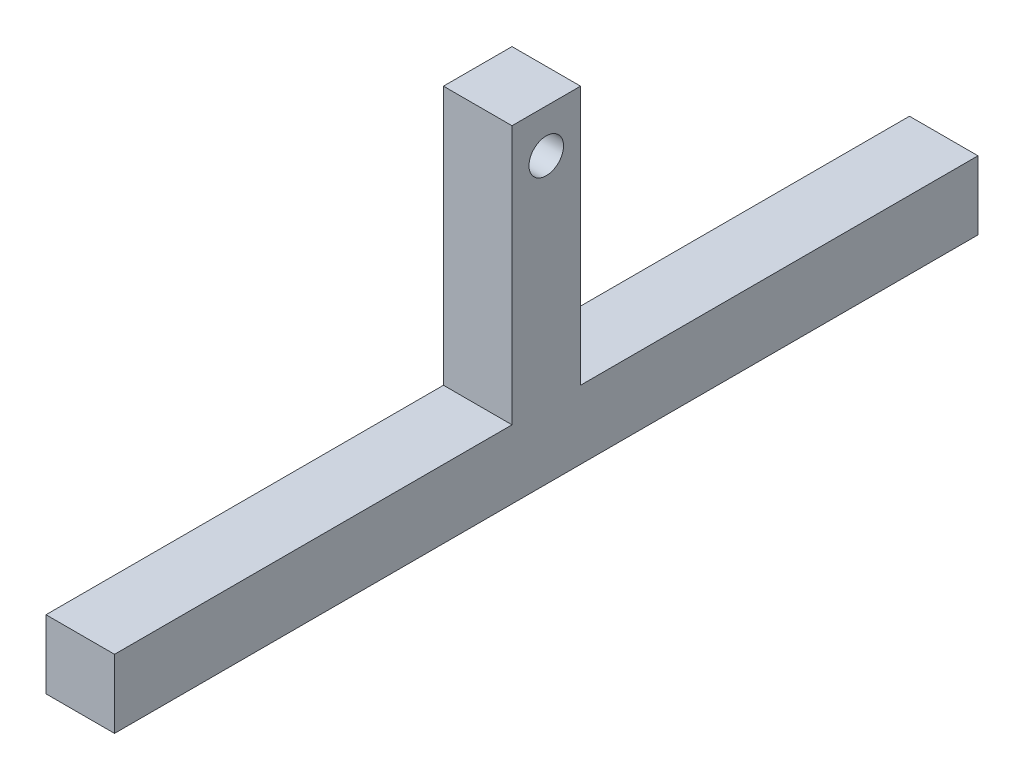
ISO-10303-21;
HEADER;
FILE_DESCRIPTION(('STEP AP214'),'2;1');
FILE_NAME('part.step','',(''),(''),'','','');
FILE_SCHEMA(('AUTOMOTIVE_DESIGN { 1 0 10303 214 1 1 1 1 }'));
ENDSEC;
DATA;
#1=APPLICATION_CONTEXT('core data for automotive mechanical design processes');
#2=APPLICATION_PROTOCOL_DEFINITION('international standard','automotive_design',2000,#1);
#3=PRODUCT_CONTEXT('',#1,'mechanical');
#4=PRODUCT('Part','Part','',(#3));
#5=PRODUCT_RELATED_PRODUCT_CATEGORY('part','',(#4));
#6=PRODUCT_DEFINITION_FORMATION('','',#4);
#7=PRODUCT_DEFINITION_CONTEXT('part definition',#1,'design');
#8=PRODUCT_DEFINITION('design','',#6,#7);
#9=PRODUCT_DEFINITION_SHAPE('','',#8);
#10=(LENGTH_UNIT() NAMED_UNIT(*) SI_UNIT(.MILLI.,.METRE.));
#11=(NAMED_UNIT(*) PLANE_ANGLE_UNIT() SI_UNIT($,.RADIAN.));
#12=(NAMED_UNIT(*) SI_UNIT($,.STERADIAN.) SOLID_ANGLE_UNIT());
#13=UNCERTAINTY_MEASURE_WITH_UNIT(LENGTH_MEASURE(1.E-05),#10,'distance_accuracy_value','');
#14=(GEOMETRIC_REPRESENTATION_CONTEXT(3) GLOBAL_UNCERTAINTY_ASSIGNED_CONTEXT((#13)) GLOBAL_UNIT_ASSIGNED_CONTEXT((#10,
#11,#12)) REPRESENTATION_CONTEXT('',''));
#15=CARTESIAN_POINT('',(0.,0.,0.));
#16=DIRECTION('',(0.,0.,1.));
#17=DIRECTION('',(1.,0.,0.));
#18=AXIS2_PLACEMENT_3D('',#15,#16,#17);
#19=CARTESIAN_POINT('',(15.875,0.,100.));
#20=DIRECTION('',(0.,0.,1.));
#21=DIRECTION('',(-1.,0.,0.));
#22=AXIS2_PLACEMENT_3D('',#19,#20,#21);
#23=PLANE('',#22);
#24=DIRECTION('',(0.,-1.,0.));
#25=VECTOR('',#24,1.);
#26=CARTESIAN_POINT('',(0.,0.,100.));
#27=LINE('',#26,#25);
#28=CARTESIAN_POINT('',(0.,7.9375,100.));
#29=VERTEX_POINT('',#28);
#30=CARTESIAN_POINT('',(0.,-7.9375,100.));
#31=VERTEX_POINT('',#30);
#32=EDGE_CURVE('E145',#29,#31,#27,.T.);
#33=ORIENTED_EDGE('',*,*,#32,.T.);
#34=DIRECTION('',(-1.,0.,0.));
#35=VECTOR('',#34,1.);
#36=CARTESIAN_POINT('',(15.875,-7.9375,100.));
#37=LINE('',#36,#35);
#38=CARTESIAN_POINT('',(15.875,-7.9375,100.));
#39=VERTEX_POINT('',#38);
#40=EDGE_CURVE('E164',#39,#31,#37,.T.);
#41=ORIENTED_EDGE('',*,*,#40,.F.);
#42=DIRECTION('',(0.,-1.,0.));
#43=VECTOR('',#42,1.);
#44=CARTESIAN_POINT('',(15.875,0.,100.));
#45=LINE('',#44,#43);
#46=CARTESIAN_POINT('',(15.875,7.9375,100.));
#47=VERTEX_POINT('',#46);
#48=EDGE_CURVE('E134',#47,#39,#45,.T.);
#49=ORIENTED_EDGE('',*,*,#48,.F.);
#50=DIRECTION('',(-1.,0.,0.));
#51=VECTOR('',#50,1.);
#52=CARTESIAN_POINT('',(15.875,7.9375,100.));
#53=LINE('',#52,#51);
#54=EDGE_CURVE('E11',#47,#29,#53,.T.);
#55=ORIENTED_EDGE('',*,*,#54,.T.);
#56=EDGE_LOOP('',(#33,#41,#49,#55));
#57=FACE_BOUND('',#56,.T.);
#58=ADVANCED_FACE('F39',(#57),#23,.T.);
#59=CARTESIAN_POINT('',(15.875,7.9375,0.));
#60=DIRECTION('',(0.,1.,0.));
#61=DIRECTION('',(0.,0.,-1.));
#62=AXIS2_PLACEMENT_3D('',#59,#60,#61);
#63=PLANE('',#62);
#64=DIRECTION('',(0.,0.,1.));
#65=VECTOR('',#64,1.);
#66=CARTESIAN_POINT('',(0.,7.9375,0.));
#67=LINE('',#66,#65);
#68=CARTESIAN_POINT('',(0.,7.9375,7.9375));
#69=VERTEX_POINT('',#68);
#70=EDGE_CURVE('E149',#69,#29,#67,.T.);
#71=ORIENTED_EDGE('',*,*,#70,.T.);
#72=ORIENTED_EDGE('',*,*,#54,.F.);
#73=DIRECTION('',(0.,0.,1.));
#74=VECTOR('',#73,1.);
#75=CARTESIAN_POINT('',(15.875,7.9375,0.));
#76=LINE('',#75,#74);
#77=CARTESIAN_POINT('',(15.875,7.9375,7.9375));
#78=VERTEX_POINT('',#77);
#79=EDGE_CURVE('E93',#78,#47,#76,.T.);
#80=ORIENTED_EDGE('',*,*,#79,.F.);
#81=DIRECTION('',(-1.,0.,0.));
#82=VECTOR('',#81,1.);
#83=CARTESIAN_POINT('',(15.875,7.9375,7.9375));
#84=LINE('',#83,#82);
#85=EDGE_CURVE('E47',#78,#69,#84,.T.);
#86=ORIENTED_EDGE('',*,*,#85,.T.);
#87=EDGE_LOOP('',(#71,#72,#80,#86));
#88=FACE_BOUND('',#87,.T.);
#89=ADVANCED_FACE('F177',(#88),#63,.T.);
#90=CARTESIAN_POINT('',(15.875,0.,7.9375));
#91=DIRECTION('',(0.,0.,-1.));
#92=DIRECTION('',(1.,0.,0.));
#93=AXIS2_PLACEMENT_3D('',#90,#91,#92);
#94=PLANE('',#93);
#95=DIRECTION('',(0.,1.,0.));
#96=VECTOR('',#95,1.);
#97=CARTESIAN_POINT('',(0.,0.,7.9375));
#98=LINE('',#97,#96);
#99=CARTESIAN_POINT('',(0.,67.9375,7.9375));
#100=VERTEX_POINT('',#99);
#101=EDGE_CURVE('E152',#69,#100,#98,.T.);
#102=ORIENTED_EDGE('',*,*,#101,.F.);
#103=ORIENTED_EDGE('',*,*,#85,.F.);
#104=DIRECTION('',(0.,1.,0.));
#105=VECTOR('',#104,1.);
#106=CARTESIAN_POINT('',(15.875,0.,7.9375));
#107=LINE('',#106,#105);
#108=CARTESIAN_POINT('',(15.875,67.9375,7.9375));
#109=VERTEX_POINT('',#108);
#110=EDGE_CURVE('E133',#78,#109,#107,.T.);
#111=ORIENTED_EDGE('',*,*,#110,.T.);
#112=DIRECTION('',(-1.,0.,0.));
#113=VECTOR('',#112,1.);
#114=CARTESIAN_POINT('',(15.875,67.9375,7.9375));
#115=LINE('',#114,#113);
#116=EDGE_CURVE('E171',#109,#100,#115,.T.);
#117=ORIENTED_EDGE('',*,*,#116,.T.);
#118=EDGE_LOOP('',(#102,#103,#111,#117));
#119=FACE_BOUND('',#118,.T.);
#120=ADVANCED_FACE('F182',(#119),#94,.F.);
#121=CARTESIAN_POINT('',(15.875,67.9375,0.));
#122=DIRECTION('',(0.,1.,0.));
#123=DIRECTION('',(0.,0.,-1.));
#124=AXIS2_PLACEMENT_3D('',#121,#122,#123);
#125=PLANE('',#124);
#126=DIRECTION('',(0.,0.,1.));
#127=VECTOR('',#126,1.);
#128=CARTESIAN_POINT('',(0.,67.9375,0.));
#129=LINE('',#128,#127);
#130=CARTESIAN_POINT('',(0.,67.9375,-7.9375));
#131=VERTEX_POINT('',#130);
#132=EDGE_CURVE('E159',#131,#100,#129,.T.);
#133=ORIENTED_EDGE('',*,*,#132,.T.);
#134=ORIENTED_EDGE('',*,*,#116,.F.);
#135=DIRECTION('',(0.,0.,1.));
#136=VECTOR('',#135,1.);
#137=CARTESIAN_POINT('',(15.875,67.9375,0.));
#138=LINE('',#137,#136);
#139=CARTESIAN_POINT('',(15.875,67.9375,-7.9375));
#140=VERTEX_POINT('',#139);
#141=EDGE_CURVE('E129',#140,#109,#138,.T.);
#142=ORIENTED_EDGE('',*,*,#141,.F.);
#143=DIRECTION('',(-1.,0.,0.));
#144=VECTOR('',#143,1.);
#145=CARTESIAN_POINT('',(15.875,67.9375,-7.9375));
#146=LINE('',#145,#144);
#147=EDGE_CURVE('E168',#140,#131,#146,.T.);
#148=ORIENTED_EDGE('',*,*,#147,.T.);
#149=EDGE_LOOP('',(#133,#134,#142,#148));
#150=FACE_BOUND('',#149,.T.);
#151=ADVANCED_FACE('F186',(#150),#125,.T.);
#152=CARTESIAN_POINT('',(15.875,0.,-7.9375));
#153=DIRECTION('',(0.,0.,-1.));
#154=DIRECTION('',(1.,0.,0.));
#155=AXIS2_PLACEMENT_3D('',#152,#153,#154);
#156=PLANE('',#155);
#157=DIRECTION('',(0.,1.,0.));
#158=VECTOR('',#157,1.);
#159=CARTESIAN_POINT('',(0.,0.,-7.9375));
#160=LINE('',#159,#158);
#161=CARTESIAN_POINT('',(0.,7.9375,-7.9375));
#162=VERTEX_POINT('',#161);
#163=EDGE_CURVE('E161',#162,#131,#160,.T.);
#164=ORIENTED_EDGE('',*,*,#163,.T.);
#165=ORIENTED_EDGE('',*,*,#147,.F.);
#166=DIRECTION('',(0.,1.,0.));
#167=VECTOR('',#166,1.);
#168=CARTESIAN_POINT('',(15.875,0.,-7.9375));
#169=LINE('',#168,#167);
#170=CARTESIAN_POINT('',(15.875,7.9375,-7.9375));
#171=VERTEX_POINT('',#170);
#172=EDGE_CURVE('E127',#171,#140,#169,.T.);
#173=ORIENTED_EDGE('',*,*,#172,.F.);
#174=DIRECTION('',(-1.,0.,0.));
#175=VECTOR('',#174,1.);
#176=CARTESIAN_POINT('',(15.875,7.9375,-7.9375));
#177=LINE('',#176,#175);
#178=EDGE_CURVE('E121',#171,#162,#177,.T.);
#179=ORIENTED_EDGE('',*,*,#178,.T.);
#180=EDGE_LOOP('',(#164,#165,#173,#179));
#181=FACE_BOUND('',#180,.T.);
#182=ADVANCED_FACE('F189',(#181),#156,.T.);
#183=CARTESIAN_POINT('',(0.,7.9375,-100.));
#184=VERTEX_POINT('',#183);
#185=EDGE_CURVE('E154',#184,#162,#67,.T.);
#186=ORIENTED_EDGE('',*,*,#185,.T.);
#187=ORIENTED_EDGE('',*,*,#178,.F.);
#188=CARTESIAN_POINT('',(15.875,7.9375,-100.));
#189=VERTEX_POINT('',#188);
#190=EDGE_CURVE('E111',#189,#171,#76,.T.);
#191=ORIENTED_EDGE('',*,*,#190,.F.);
#192=DIRECTION('',(-1.,0.,0.));
#193=VECTOR('',#192,1.);
#194=CARTESIAN_POINT('',(15.875,7.9375,-100.));
#195=LINE('',#194,#193);
#196=EDGE_CURVE('E116',#189,#184,#195,.T.);
#197=ORIENTED_EDGE('',*,*,#196,.T.);
#198=EDGE_LOOP('',(#186,#187,#191,#197));
#199=FACE_BOUND('',#198,.T.);
#200=ADVANCED_FACE('F124',(#199),#63,.T.);
#201=CARTESIAN_POINT('',(15.875,0.,-100.));
#202=DIRECTION('',(0.,0.,1.));
#203=DIRECTION('',(-1.,0.,0.));
#204=AXIS2_PLACEMENT_3D('',#201,#202,#203);
#205=PLANE('',#204);
#206=DIRECTION('',(0.,-1.,0.));
#207=VECTOR('',#206,1.);
#208=CARTESIAN_POINT('',(0.,0.,-100.));
#209=LINE('',#208,#207);
#210=CARTESIAN_POINT('',(0.,-7.9375,-100.));
#211=VERTEX_POINT('',#210);
#212=EDGE_CURVE('E118',#184,#211,#209,.T.);
#213=ORIENTED_EDGE('',*,*,#212,.F.);
#214=ORIENTED_EDGE('',*,*,#196,.F.);
#215=DIRECTION('',(0.,-1.,0.));
#216=VECTOR('',#215,1.);
#217=CARTESIAN_POINT('',(15.875,0.,-100.));
#218=LINE('',#217,#216);
#219=CARTESIAN_POINT('',(15.875,-7.9375,-100.));
#220=VERTEX_POINT('',#219);
#221=EDGE_CURVE('E107',#189,#220,#218,.T.);
#222=ORIENTED_EDGE('',*,*,#221,.T.);
#223=DIRECTION('',(-1.,0.,0.));
#224=VECTOR('',#223,1.);
#225=CARTESIAN_POINT('',(15.875,-7.9375,-100.));
#226=LINE('',#225,#224);
#227=EDGE_CURVE('E122',#220,#211,#226,.T.);
#228=ORIENTED_EDGE('',*,*,#227,.T.);
#229=EDGE_LOOP('',(#213,#214,#222,#228));
#230=FACE_BOUND('',#229,.T.);
#231=ADVANCED_FACE('F117',(#230),#205,.F.);
#232=CARTESIAN_POINT('',(15.875,-7.9375,0.));
#233=DIRECTION('',(0.,1.,0.));
#234=DIRECTION('',(0.,0.,-1.));
#235=AXIS2_PLACEMENT_3D('',#232,#233,#234);
#236=PLANE('',#235);
#237=DIRECTION('',(0.,0.,1.));
#238=VECTOR('',#237,1.);
#239=CARTESIAN_POINT('',(0.,-7.9375,0.));
#240=LINE('',#239,#238);
#241=EDGE_CURVE('E81',#211,#31,#240,.T.);
#242=ORIENTED_EDGE('',*,*,#241,.F.);
#243=ORIENTED_EDGE('',*,*,#227,.F.);
#244=DIRECTION('',(0.,0.,1.));
#245=VECTOR('',#244,1.);
#246=CARTESIAN_POINT('',(15.875,-7.9375,0.));
#247=LINE('',#246,#245);
#248=EDGE_CURVE('E55',#220,#39,#247,.T.);
#249=ORIENTED_EDGE('',*,*,#248,.T.);
#250=ORIENTED_EDGE('',*,*,#40,.T.);
#251=EDGE_LOOP('',(#242,#243,#249,#250));
#252=FACE_BOUND('',#251,.T.);
#253=ADVANCED_FACE('F209',(#252),#236,.F.);
#254=CARTESIAN_POINT('',(15.875,0.,0.));
#255=DIRECTION('',(1.,0.,0.));
#256=DIRECTION('',(0.,0.,1.));
#257=AXIS2_PLACEMENT_3D('',#254,#255,#256);
#258=PLANE('',#257);
#259=CARTESIAN_POINT('',(15.875,57.9375,0.));
#260=DIRECTION('',(-1.,0.,0.));
#261=DIRECTION('',(0.,0.,1.));
#262=AXIS2_PLACEMENT_3D('',#259,#260,#261);
#263=CIRCLE('',#262,4.);
#264=CARTESIAN_POINT('',(15.875,57.9375,4.));
#265=VERTEX_POINT('',#264);
#266=EDGE_CURVE('E140',#265,#265,#263,.T.);
#267=ORIENTED_EDGE('',*,*,#266,.T.);
#268=EDGE_LOOP('',(#267));
#269=FACE_BOUND('',#268,.T.);
#270=ORIENTED_EDGE('',*,*,#48,.T.);
#271=ORIENTED_EDGE('',*,*,#248,.F.);
#272=ORIENTED_EDGE('',*,*,#221,.F.);
#273=ORIENTED_EDGE('',*,*,#190,.T.);
#274=ORIENTED_EDGE('',*,*,#172,.T.);
#275=ORIENTED_EDGE('',*,*,#141,.T.);
#276=ORIENTED_EDGE('',*,*,#110,.F.);
#277=ORIENTED_EDGE('',*,*,#79,.T.);
#278=EDGE_LOOP('',(#270,#271,#272,#273,#274,#275,#276,#277));
#279=FACE_BOUND('',#278,.T.);
#280=ADVANCED_FACE('F109',(#269,#279),#258,.T.);
#281=CARTESIAN_POINT('',(0.,0.,0.));
#282=DIRECTION('',(1.,0.,0.));
#283=DIRECTION('',(0.,0.,1.));
#284=AXIS2_PLACEMENT_3D('',#281,#282,#283);
#285=PLANE('',#284);
#286=CARTESIAN_POINT('',(0.,57.9375,0.));
#287=DIRECTION('',(-1.,0.,0.));
#288=DIRECTION('',(0.,0.,1.));
#289=AXIS2_PLACEMENT_3D('',#286,#287,#288);
#290=CIRCLE('',#289,4.);
#291=CARTESIAN_POINT('',(0.,57.9375,4.));
#292=VERTEX_POINT('',#291);
#293=EDGE_CURVE('E143',#292,#292,#290,.T.);
#294=ORIENTED_EDGE('',*,*,#293,.F.);
#295=EDGE_LOOP('',(#294));
#296=FACE_BOUND('',#295,.T.);
#297=ORIENTED_EDGE('',*,*,#32,.F.);
#298=ORIENTED_EDGE('',*,*,#70,.F.);
#299=ORIENTED_EDGE('',*,*,#101,.T.);
#300=ORIENTED_EDGE('',*,*,#132,.F.);
#301=ORIENTED_EDGE('',*,*,#163,.F.);
#302=ORIENTED_EDGE('',*,*,#185,.F.);
#303=ORIENTED_EDGE('',*,*,#212,.T.);
#304=ORIENTED_EDGE('',*,*,#241,.T.);
#305=EDGE_LOOP('',(#297,#298,#299,#300,#301,#302,#303,#304));
#306=FACE_BOUND('',#305,.T.);
#307=ADVANCED_FACE('F179',(#296,#306),#285,.F.);
#308=CARTESIAN_POINT('',(0.,57.9375,0.));
#309=DIRECTION('',(1.,0.,0.));
#310=DIRECTION('',(0.,0.,1.));
#311=AXIS2_PLACEMENT_3D('',#308,#309,#310);
#312=CYLINDRICAL_SURFACE('',#311,4.);
#313=ORIENTED_EDGE('',*,*,#293,.T.);
#314=EDGE_LOOP('',(#313));
#315=FACE_BOUND('',#314,.T.);
#316=ORIENTED_EDGE('',*,*,#266,.F.);
#317=EDGE_LOOP('',(#316));
#318=FACE_BOUND('',#317,.T.);
#319=ADVANCED_FACE('F214',(#315,#318),#312,.F.);
#320=CLOSED_SHELL('',(#58,#89,#120,#151,#182,#200,#231,#253,#280,#307,#319));
#321=MANIFOLD_SOLID_BREP('B2',#320);
#322=ADVANCED_BREP_SHAPE_REPRESENTATION('',(#18,#321),#14);
#323=SHAPE_DEFINITION_REPRESENTATION(#9,#322);
ENDSEC;
END-ISO-10303-21;
